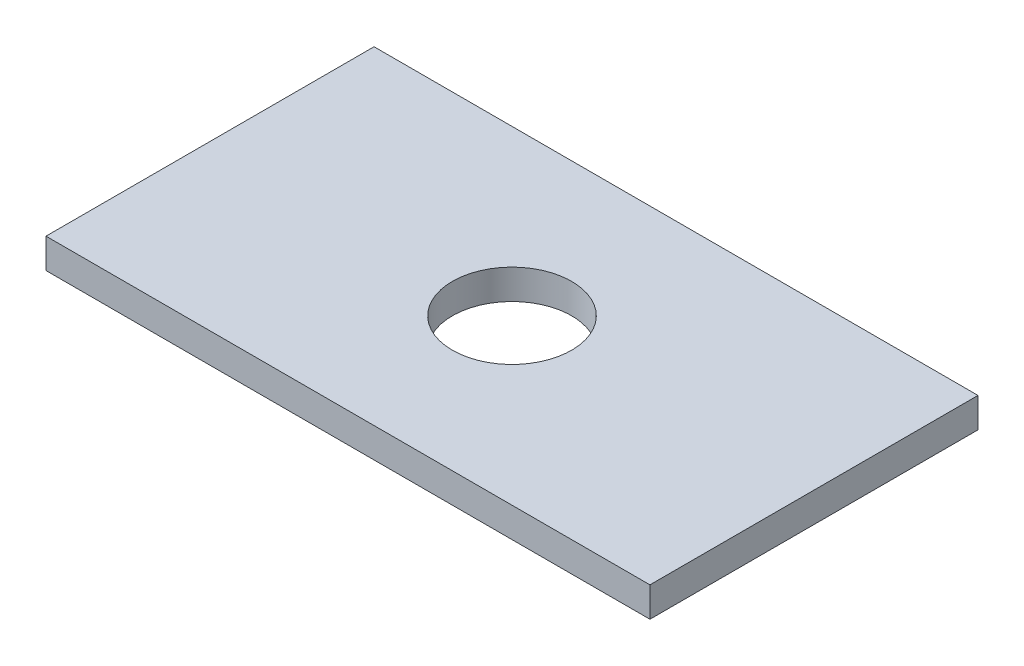
ISO-10303-21;
HEADER;
FILE_DESCRIPTION(('STEP AP214'),'2;1');
FILE_NAME('part.step','',(''),(''),'','','');
FILE_SCHEMA(('AUTOMOTIVE_DESIGN { 1 0 10303 214 1 1 1 1 }'));
ENDSEC;
DATA;
#1=APPLICATION_CONTEXT('core data for automotive mechanical design processes');
#2=APPLICATION_PROTOCOL_DEFINITION('international standard','automotive_design',2000,#1);
#3=PRODUCT_CONTEXT('',#1,'mechanical');
#4=PRODUCT('Part','Part','',(#3));
#5=PRODUCT_RELATED_PRODUCT_CATEGORY('part','',(#4));
#6=PRODUCT_DEFINITION_FORMATION('','',#4);
#7=PRODUCT_DEFINITION_CONTEXT('part definition',#1,'design');
#8=PRODUCT_DEFINITION('design','',#6,#7);
#9=PRODUCT_DEFINITION_SHAPE('','',#8);
#10=(LENGTH_UNIT() NAMED_UNIT(*) SI_UNIT(.MILLI.,.METRE.));
#11=(NAMED_UNIT(*) PLANE_ANGLE_UNIT() SI_UNIT($,.RADIAN.));
#12=(NAMED_UNIT(*) SI_UNIT($,.STERADIAN.) SOLID_ANGLE_UNIT());
#13=UNCERTAINTY_MEASURE_WITH_UNIT(LENGTH_MEASURE(1.E-05),#10,'distance_accuracy_value','');
#14=(GEOMETRIC_REPRESENTATION_CONTEXT(3) GLOBAL_UNCERTAINTY_ASSIGNED_CONTEXT((#13)) GLOBAL_UNIT_ASSIGNED_CONTEXT((#10,
#11,#12)) REPRESENTATION_CONTEXT('',''));
#15=CARTESIAN_POINT('',(0.,0.,0.));
#16=DIRECTION('',(0.,0.,1.));
#17=DIRECTION('',(1.,0.,0.));
#18=AXIS2_PLACEMENT_3D('',#15,#16,#17);
#19=CARTESIAN_POINT('',(20.25,0.,11.));
#20=DIRECTION('',(0.,0.,-1.));
#21=DIRECTION('',(-1.,0.,0.));
#22=AXIS2_PLACEMENT_3D('',#19,#20,#21);
#23=PLANE('',#22);
#24=DIRECTION('',(0.,1.,0.));
#25=VECTOR('',#24,1.);
#26=CARTESIAN_POINT('',(20.25,1.,11.));
#27=LINE('',#26,#25);
#28=CARTESIAN_POINT('',(20.25,0.,11.));
#29=VERTEX_POINT('',#28);
#30=CARTESIAN_POINT('',(20.25,2.,11.));
#31=VERTEX_POINT('',#30);
#32=EDGE_CURVE('E58',#29,#31,#27,.T.);
#33=ORIENTED_EDGE('',*,*,#32,.T.);
#34=DIRECTION('',(-1.,0.,0.));
#35=VECTOR('',#34,1.);
#36=CARTESIAN_POINT('',(0.,2.,11.));
#37=LINE('',#36,#35);
#38=CARTESIAN_POINT('',(-20.25,2.,11.));
#39=VERTEX_POINT('',#38);
#40=EDGE_CURVE('E141',#31,#39,#37,.T.);
#41=ORIENTED_EDGE('',*,*,#40,.T.);
#42=DIRECTION('',(0.,-1.,0.));
#43=VECTOR('',#42,1.);
#44=CARTESIAN_POINT('',(-20.25,1.,11.));
#45=LINE('',#44,#43);
#46=CARTESIAN_POINT('',(-20.25,0.,11.));
#47=VERTEX_POINT('',#46);
#48=EDGE_CURVE('E75',#39,#47,#45,.T.);
#49=ORIENTED_EDGE('',*,*,#48,.T.);
#50=DIRECTION('',(-1.,0.,0.));
#51=VECTOR('',#50,1.);
#52=CARTESIAN_POINT('',(0.,0.,11.));
#53=LINE('',#52,#51);
#54=EDGE_CURVE('E70',#29,#47,#53,.T.);
#55=ORIENTED_EDGE('',*,*,#54,.F.);
#56=EDGE_LOOP('',(#33,#41,#49,#55));
#57=FACE_BOUND('',#56,.T.);
#58=ADVANCED_FACE('F16',(#57),#23,.F.);
#59=CARTESIAN_POINT('',(-20.25,0.,11.));
#60=DIRECTION('',(1.,0.,0.));
#61=DIRECTION('',(0.,0.,-1.));
#62=AXIS2_PLACEMENT_3D('',#59,#60,#61);
#63=PLANE('',#62);
#64=ORIENTED_EDGE('',*,*,#48,.F.);
#65=DIRECTION('',(0.,0.,-1.));
#66=VECTOR('',#65,1.);
#67=CARTESIAN_POINT('',(-20.25,2.,0.));
#68=LINE('',#67,#66);
#69=CARTESIAN_POINT('',(-20.25,2.,-11.));
#70=VERTEX_POINT('',#69);
#71=EDGE_CURVE('E149',#39,#70,#68,.T.);
#72=ORIENTED_EDGE('',*,*,#71,.T.);
#73=DIRECTION('',(0.,-1.,0.));
#74=VECTOR('',#73,1.);
#75=CARTESIAN_POINT('',(-20.25,1.,-11.));
#76=LINE('',#75,#74);
#77=CARTESIAN_POINT('',(-20.25,0.,-11.));
#78=VERTEX_POINT('',#77);
#79=EDGE_CURVE('E66',#70,#78,#76,.T.);
#80=ORIENTED_EDGE('',*,*,#79,.T.);
#81=DIRECTION('',(0.,0.,-1.));
#82=VECTOR('',#81,1.);
#83=CARTESIAN_POINT('',(-20.25,0.,0.));
#84=LINE('',#83,#82);
#85=EDGE_CURVE('E78',#47,#78,#84,.T.);
#86=ORIENTED_EDGE('',*,*,#85,.F.);
#87=EDGE_LOOP('',(#64,#72,#80,#86));
#88=FACE_BOUND('',#87,.T.);
#89=ADVANCED_FACE('F234',(#88),#63,.F.);
#90=CARTESIAN_POINT('',(-20.25,0.,-11.));
#91=DIRECTION('',(0.,0.,1.));
#92=DIRECTION('',(1.,0.,0.));
#93=AXIS2_PLACEMENT_3D('',#90,#91,#92);
#94=PLANE('',#93);
#95=ORIENTED_EDGE('',*,*,#79,.F.);
#96=DIRECTION('',(1.,0.,0.));
#97=VECTOR('',#96,1.);
#98=CARTESIAN_POINT('',(0.,2.,-11.));
#99=LINE('',#98,#97);
#100=CARTESIAN_POINT('',(20.25,2.,-11.));
#101=VERTEX_POINT('',#100);
#102=EDGE_CURVE('E159',#70,#101,#99,.T.);
#103=ORIENTED_EDGE('',*,*,#102,.T.);
#104=DIRECTION('',(0.,-1.,0.));
#105=VECTOR('',#104,1.);
#106=CARTESIAN_POINT('',(20.25,1.,-11.));
#107=LINE('',#106,#105);
#108=CARTESIAN_POINT('',(20.25,0.,-11.));
#109=VERTEX_POINT('',#108);
#110=EDGE_CURVE('E35',#101,#109,#107,.T.);
#111=ORIENTED_EDGE('',*,*,#110,.T.);
#112=DIRECTION('',(1.,0.,0.));
#113=VECTOR('',#112,1.);
#114=CARTESIAN_POINT('',(0.,0.,-11.));
#115=LINE('',#114,#113);
#116=EDGE_CURVE('E72',#78,#109,#115,.T.);
#117=ORIENTED_EDGE('',*,*,#116,.F.);
#118=EDGE_LOOP('',(#95,#103,#111,#117));
#119=FACE_BOUND('',#118,.T.);
#120=ADVANCED_FACE('F223',(#119),#94,.F.);
#121=CARTESIAN_POINT('',(20.25,0.,-11.));
#122=DIRECTION('',(-1.,0.,0.));
#123=DIRECTION('',(0.,0.,1.));
#124=AXIS2_PLACEMENT_3D('',#121,#122,#123);
#125=PLANE('',#124);
#126=ORIENTED_EDGE('',*,*,#110,.F.);
#127=DIRECTION('',(0.,0.,1.));
#128=VECTOR('',#127,1.);
#129=CARTESIAN_POINT('',(20.25,2.,0.));
#130=LINE('',#129,#128);
#131=EDGE_CURVE('E27',#101,#31,#130,.T.);
#132=ORIENTED_EDGE('',*,*,#131,.T.);
#133=ORIENTED_EDGE('',*,*,#32,.F.);
#134=DIRECTION('',(0.,0.,1.));
#135=VECTOR('',#134,1.);
#136=CARTESIAN_POINT('',(20.25,0.,0.));
#137=LINE('',#136,#135);
#138=EDGE_CURVE('E61',#109,#29,#137,.T.);
#139=ORIENTED_EDGE('',*,*,#138,.F.);
#140=EDGE_LOOP('',(#126,#132,#133,#139));
#141=FACE_BOUND('',#140,.T.);
#142=ADVANCED_FACE('F60',(#141),#125,.F.);
#143=CARTESIAN_POINT('',(0.,0.,0.));
#144=DIRECTION('',(0.,1.,0.));
#145=DIRECTION('',(0.,0.,1.));
#146=AXIS2_PLACEMENT_3D('',#143,#144,#145);
#147=CYLINDRICAL_SURFACE('',#146,4.);
#148=CARTESIAN_POINT('',(0.,0.,0.));
#149=DIRECTION('',(0.,1.,0.));
#150=DIRECTION('',(0.,0.,1.));
#151=AXIS2_PLACEMENT_3D('',#148,#149,#150);
#152=CIRCLE('',#151,4.);
#153=CARTESIAN_POINT('',(0.,0.,4.));
#154=VERTEX_POINT('',#153);
#155=EDGE_CURVE('E20',#154,#154,#152,.T.);
#156=ORIENTED_EDGE('',*,*,#155,.F.);
#157=EDGE_LOOP('',(#156));
#158=FACE_BOUND('',#157,.T.);
#159=CARTESIAN_POINT('',(0.,2.,0.));
#160=DIRECTION('',(0.,1.,0.));
#161=DIRECTION('',(0.,0.,1.));
#162=AXIS2_PLACEMENT_3D('',#159,#160,#161);
#163=CIRCLE('',#162,4.);
#164=CARTESIAN_POINT('',(0.,2.,4.));
#165=VERTEX_POINT('',#164);
#166=EDGE_CURVE('E11',#165,#165,#163,.T.);
#167=ORIENTED_EDGE('',*,*,#166,.T.);
#168=EDGE_LOOP('',(#167));
#169=FACE_BOUND('',#168,.T.);
#170=ADVANCED_FACE('F201',(#158,#169),#147,.F.);
#171=CARTESIAN_POINT('',(-20.25,0.,11.));
#172=DIRECTION('',(0.,-1.,0.));
#173=DIRECTION('',(0.,0.,-1.));
#174=AXIS2_PLACEMENT_3D('',#171,#172,#173);
#175=PLANE('',#174);
#176=ORIENTED_EDGE('',*,*,#155,.T.);
#177=EDGE_LOOP('',(#176));
#178=FACE_BOUND('',#177,.T.);
#179=ORIENTED_EDGE('',*,*,#85,.T.);
#180=ORIENTED_EDGE('',*,*,#116,.T.);
#181=ORIENTED_EDGE('',*,*,#138,.T.);
#182=ORIENTED_EDGE('',*,*,#54,.T.);
#183=EDGE_LOOP('',(#179,#180,#181,#182));
#184=FACE_BOUND('',#183,.T.);
#185=ADVANCED_FACE('F69',(#178,#184),#175,.T.);
#186=CARTESIAN_POINT('',(-20.25,2.,11.));
#187=DIRECTION('',(0.,-1.,0.));
#188=DIRECTION('',(0.,0.,-1.));
#189=AXIS2_PLACEMENT_3D('',#186,#187,#188);
#190=PLANE('',#189);
#191=ORIENTED_EDGE('',*,*,#166,.F.);
#192=EDGE_LOOP('',(#191));
#193=FACE_BOUND('',#192,.T.);
#194=ORIENTED_EDGE('',*,*,#102,.F.);
#195=ORIENTED_EDGE('',*,*,#71,.F.);
#196=ORIENTED_EDGE('',*,*,#40,.F.);
#197=ORIENTED_EDGE('',*,*,#131,.F.);
#198=EDGE_LOOP('',(#194,#195,#196,#197));
#199=FACE_BOUND('',#198,.T.);
#200=ADVANCED_FACE('F18',(#193,#199),#190,.F.);
#201=CLOSED_SHELL('',(#58,#89,#120,#142,#170,#185,#200));
#202=MANIFOLD_SOLID_BREP('B1',#201);
#203=ADVANCED_BREP_SHAPE_REPRESENTATION('',(#18,#202),#14);
#204=SHAPE_DEFINITION_REPRESENTATION(#9,#203);
ENDSEC;
END-ISO-10303-21;
